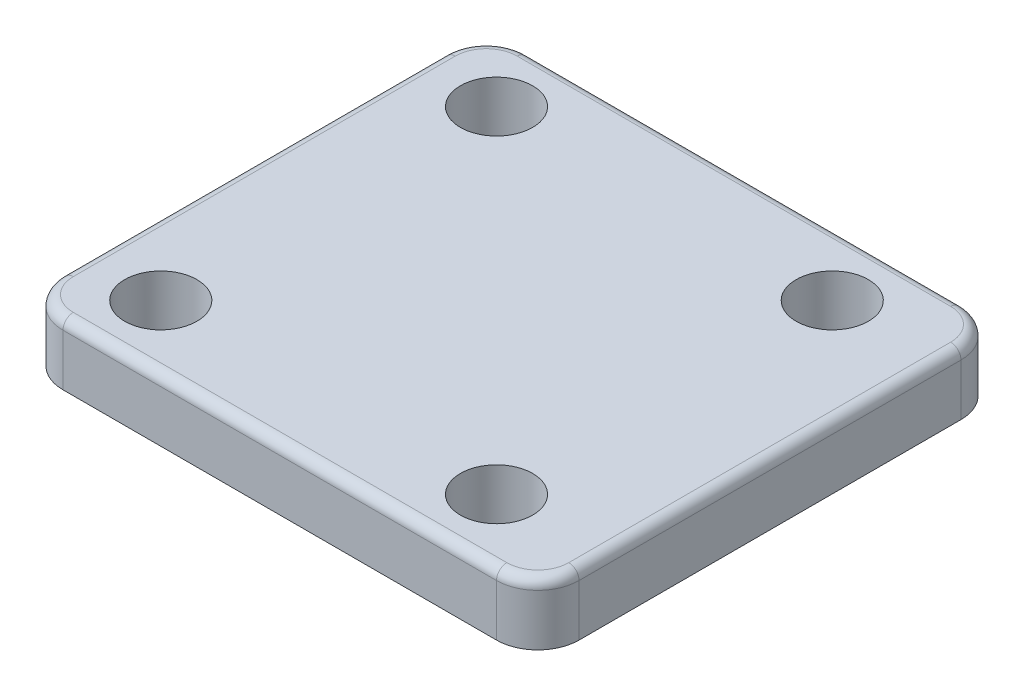
ISO-10303-21;
HEADER;
FILE_DESCRIPTION(('STEP AP214'),'2;1');
FILE_NAME('part.step','',(''),(''),'','','');
FILE_SCHEMA(('AUTOMOTIVE_DESIGN { 1 0 10303 214 1 1 1 1 }'));
ENDSEC;
DATA;
#1=APPLICATION_CONTEXT('core data for automotive mechanical design processes');
#2=APPLICATION_PROTOCOL_DEFINITION('international standard','automotive_design',2000,#1);
#3=PRODUCT_CONTEXT('',#1,'mechanical');
#4=PRODUCT('Part','Part','',(#3));
#5=PRODUCT_RELATED_PRODUCT_CATEGORY('part','',(#4));
#6=PRODUCT_DEFINITION_FORMATION('','',#4);
#7=PRODUCT_DEFINITION_CONTEXT('part definition',#1,'design');
#8=PRODUCT_DEFINITION('design','',#6,#7);
#9=PRODUCT_DEFINITION_SHAPE('','',#8);
#10=(LENGTH_UNIT() NAMED_UNIT(*) SI_UNIT(.MILLI.,.METRE.));
#11=(NAMED_UNIT(*) PLANE_ANGLE_UNIT() SI_UNIT($,.RADIAN.));
#12=(NAMED_UNIT(*) SI_UNIT($,.STERADIAN.) SOLID_ANGLE_UNIT());
#13=UNCERTAINTY_MEASURE_WITH_UNIT(LENGTH_MEASURE(1.E-05),#10,'distance_accuracy_value','');
#14=(GEOMETRIC_REPRESENTATION_CONTEXT(3) GLOBAL_UNCERTAINTY_ASSIGNED_CONTEXT((#13)) GLOBAL_UNIT_ASSIGNED_CONTEXT((#10,
#11,#12)) REPRESENTATION_CONTEXT('',''));
#15=CARTESIAN_POINT('',(0.,0.,0.));
#16=DIRECTION('',(0.,0.,1.));
#17=DIRECTION('',(1.,0.,0.));
#18=AXIS2_PLACEMENT_3D('',#15,#16,#17);
#19=CARTESIAN_POINT('',(21.,6.,18.5));
#20=DIRECTION('',(0.,-1.,0.));
#21=DIRECTION('',(0.,0.,-1.));
#22=AXIS2_PLACEMENT_3D('',#19,#20,#21);
#23=CYLINDRICAL_SURFACE('',#22,4.);
#24=DIRECTION('',(0.,-1.,0.));
#25=VECTOR('',#24,1.);
#26=CARTESIAN_POINT('',(25.,6.,18.5));
#27=LINE('',#26,#25);
#28=CARTESIAN_POINT('',(25.,5.,18.5));
#29=VERTEX_POINT('',#28);
#30=CARTESIAN_POINT('',(25.,0.,18.5));
#31=VERTEX_POINT('',#30);
#32=EDGE_CURVE('E137',#29,#31,#27,.T.);
#33=ORIENTED_EDGE('',*,*,#32,.F.);
#34=CARTESIAN_POINT('',(21.,5.,18.5));
#35=DIRECTION('',(0.,-1.,0.));
#36=DIRECTION('',(0.,0.,-1.));
#37=AXIS2_PLACEMENT_3D('',#34,#35,#36);
#38=CIRCLE('',#37,4.);
#39=CARTESIAN_POINT('',(21.,5.,22.5));
#40=VERTEX_POINT('',#39);
#41=EDGE_CURVE('E255',#29,#40,#38,.T.);
#42=ORIENTED_EDGE('',*,*,#41,.T.);
#43=DIRECTION('',(0.,-1.,0.));
#44=VECTOR('',#43,1.);
#45=CARTESIAN_POINT('',(21.,6.,22.5));
#46=LINE('',#45,#44);
#47=CARTESIAN_POINT('',(21.,0.,22.5));
#48=VERTEX_POINT('',#47);
#49=EDGE_CURVE('E160',#40,#48,#46,.T.);
#50=ORIENTED_EDGE('',*,*,#49,.T.);
#51=CARTESIAN_POINT('',(21.,0.,18.5));
#52=DIRECTION('',(0.,1.,0.));
#53=DIRECTION('',(0.,0.,-1.));
#54=AXIS2_PLACEMENT_3D('',#51,#52,#53);
#55=CIRCLE('',#54,4.);
#56=EDGE_CURVE('E153',#48,#31,#55,.T.);
#57=ORIENTED_EDGE('',*,*,#56,.T.);
#58=EDGE_LOOP('',(#33,#42,#50,#57));
#59=FACE_BOUND('',#58,.T.);
#60=ADVANCED_FACE('F47',(#59),#23,.T.);
#61=CARTESIAN_POINT('',(25.,6.,18.5));
#62=DIRECTION('',(-1.,0.,0.));
#63=DIRECTION('',(0.,0.,1.));
#64=AXIS2_PLACEMENT_3D('',#61,#62,#63);
#65=PLANE('',#64);
#66=DIRECTION('',(0.,-1.,0.));
#67=VECTOR('',#66,1.);
#68=CARTESIAN_POINT('',(25.,6.,-18.5));
#69=LINE('',#68,#67);
#70=CARTESIAN_POINT('',(25.,5.,-18.5));
#71=VERTEX_POINT('',#70);
#72=CARTESIAN_POINT('',(25.,0.,-18.5));
#73=VERTEX_POINT('',#72);
#74=EDGE_CURVE('E147',#71,#73,#69,.T.);
#75=ORIENTED_EDGE('',*,*,#74,.F.);
#76=DIRECTION('',(0.,0.,-1.));
#77=VECTOR('',#76,1.);
#78=CARTESIAN_POINT('',(25.,5.,18.5));
#79=LINE('',#78,#77);
#80=EDGE_CURVE('E64',#71,#29,#79,.F.);
#81=ORIENTED_EDGE('',*,*,#80,.T.);
#82=ORIENTED_EDGE('',*,*,#32,.T.);
#83=DIRECTION('',(0.,0.,-1.));
#84=VECTOR('',#83,1.);
#85=CARTESIAN_POINT('',(25.,0.,18.5));
#86=LINE('',#85,#84);
#87=EDGE_CURVE('E140',#31,#73,#86,.T.);
#88=ORIENTED_EDGE('',*,*,#87,.T.);
#89=EDGE_LOOP('',(#75,#81,#82,#88));
#90=FACE_BOUND('',#89,.T.);
#91=ADVANCED_FACE('F139',(#90),#65,.F.);
#92=CARTESIAN_POINT('',(21.,6.,-18.5));
#93=DIRECTION('',(0.,-1.,0.));
#94=DIRECTION('',(0.,0.,-1.));
#95=AXIS2_PLACEMENT_3D('',#92,#93,#94);
#96=CYLINDRICAL_SURFACE('',#95,4.);
#97=DIRECTION('',(0.,-1.,0.));
#98=VECTOR('',#97,1.);
#99=CARTESIAN_POINT('',(21.,6.,-22.5));
#100=LINE('',#99,#98);
#101=CARTESIAN_POINT('',(21.,5.,-22.5));
#102=VERTEX_POINT('',#101);
#103=CARTESIAN_POINT('',(21.,0.,-22.5));
#104=VERTEX_POINT('',#103);
#105=EDGE_CURVE('E206',#102,#104,#100,.T.);
#106=ORIENTED_EDGE('',*,*,#105,.F.);
#107=CARTESIAN_POINT('',(21.,5.,-18.5));
#108=DIRECTION('',(0.,-1.,0.));
#109=DIRECTION('',(0.,0.,-1.));
#110=AXIS2_PLACEMENT_3D('',#107,#108,#109);
#111=CIRCLE('',#110,4.);
#112=EDGE_CURVE('E72',#102,#71,#111,.T.);
#113=ORIENTED_EDGE('',*,*,#112,.T.);
#114=ORIENTED_EDGE('',*,*,#74,.T.);
#115=CARTESIAN_POINT('',(21.,0.,-18.5));
#116=DIRECTION('',(0.,1.,0.));
#117=DIRECTION('',(0.,0.,1.));
#118=AXIS2_PLACEMENT_3D('',#115,#116,#117);
#119=CIRCLE('',#118,4.);
#120=EDGE_CURVE('E156',#73,#104,#119,.T.);
#121=ORIENTED_EDGE('',*,*,#120,.T.);
#122=EDGE_LOOP('',(#106,#113,#114,#121));
#123=FACE_BOUND('',#122,.T.);
#124=ADVANCED_FACE('F339',(#123),#96,.T.);
#125=CARTESIAN_POINT('',(-21.,6.,-22.5));
#126=DIRECTION('',(0.,0.,1.));
#127=DIRECTION('',(1.,0.,0.));
#128=AXIS2_PLACEMENT_3D('',#125,#126,#127);
#129=PLANE('',#128);
#130=DIRECTION('',(0.,-1.,0.));
#131=VECTOR('',#130,1.);
#132=CARTESIAN_POINT('',(-21.,6.,-22.5));
#133=LINE('',#132,#131);
#134=CARTESIAN_POINT('',(-21.,5.,-22.5));
#135=VERTEX_POINT('',#134);
#136=CARTESIAN_POINT('',(-21.,0.,-22.5));
#137=VERTEX_POINT('',#136);
#138=EDGE_CURVE('E203',#135,#137,#133,.T.);
#139=ORIENTED_EDGE('',*,*,#138,.F.);
#140=DIRECTION('',(-1.,0.,0.));
#141=VECTOR('',#140,1.);
#142=CARTESIAN_POINT('',(-21.,5.,-22.5));
#143=LINE('',#142,#141);
#144=EDGE_CURVE('E248',#135,#102,#143,.F.);
#145=ORIENTED_EDGE('',*,*,#144,.T.);
#146=ORIENTED_EDGE('',*,*,#105,.T.);
#147=DIRECTION('',(-1.,0.,0.));
#148=VECTOR('',#147,1.);
#149=CARTESIAN_POINT('',(-21.,0.,-22.5));
#150=LINE('',#149,#148);
#151=EDGE_CURVE('E173',#104,#137,#150,.T.);
#152=ORIENTED_EDGE('',*,*,#151,.T.);
#153=EDGE_LOOP('',(#139,#145,#146,#152));
#154=FACE_BOUND('',#153,.T.);
#155=ADVANCED_FACE('F337',(#154),#129,.F.);
#156=CARTESIAN_POINT('',(-21.,6.,-18.5));
#157=DIRECTION('',(0.,-1.,0.));
#158=DIRECTION('',(0.,0.,-1.));
#159=AXIS2_PLACEMENT_3D('',#156,#157,#158);
#160=CYLINDRICAL_SURFACE('',#159,4.);
#161=DIRECTION('',(0.,-1.,0.));
#162=VECTOR('',#161,1.);
#163=CARTESIAN_POINT('',(-25.,6.,-18.5));
#164=LINE('',#163,#162);
#165=CARTESIAN_POINT('',(-25.,5.,-18.5));
#166=VERTEX_POINT('',#165);
#167=CARTESIAN_POINT('',(-25.,0.,-18.5));
#168=VERTEX_POINT('',#167);
#169=EDGE_CURVE('E200',#166,#168,#164,.T.);
#170=ORIENTED_EDGE('',*,*,#169,.F.);
#171=CARTESIAN_POINT('',(-21.,5.,-18.5));
#172=DIRECTION('',(0.,-1.,0.));
#173=DIRECTION('',(0.,0.,-1.));
#174=AXIS2_PLACEMENT_3D('',#171,#172,#173);
#175=CIRCLE('',#174,4.);
#176=EDGE_CURVE('E245',#166,#135,#175,.T.);
#177=ORIENTED_EDGE('',*,*,#176,.T.);
#178=ORIENTED_EDGE('',*,*,#138,.T.);
#179=CARTESIAN_POINT('',(-21.,0.,-18.5));
#180=DIRECTION('',(0.,1.,0.));
#181=DIRECTION('',(0.,0.,-1.));
#182=AXIS2_PLACEMENT_3D('',#179,#180,#181);
#183=CIRCLE('',#182,4.);
#184=EDGE_CURVE('E177',#137,#168,#183,.T.);
#185=ORIENTED_EDGE('',*,*,#184,.T.);
#186=EDGE_LOOP('',(#170,#177,#178,#185));
#187=FACE_BOUND('',#186,.T.);
#188=ADVANCED_FACE('F335',(#187),#160,.T.);
#189=CARTESIAN_POINT('',(-25.,6.,18.5));
#190=DIRECTION('',(1.,0.,0.));
#191=DIRECTION('',(0.,0.,-1.));
#192=AXIS2_PLACEMENT_3D('',#189,#190,#191);
#193=PLANE('',#192);
#194=DIRECTION('',(0.,-1.,0.));
#195=VECTOR('',#194,1.);
#196=CARTESIAN_POINT('',(-25.,6.,18.5));
#197=LINE('',#196,#195);
#198=CARTESIAN_POINT('',(-25.,5.,18.5));
#199=VERTEX_POINT('',#198);
#200=CARTESIAN_POINT('',(-25.,0.,18.5));
#201=VERTEX_POINT('',#200);
#202=EDGE_CURVE('E197',#199,#201,#197,.T.);
#203=ORIENTED_EDGE('',*,*,#202,.F.);
#204=DIRECTION('',(0.,0.,1.));
#205=VECTOR('',#204,1.);
#206=CARTESIAN_POINT('',(-25.,5.,18.5));
#207=LINE('',#206,#205);
#208=EDGE_CURVE('E242',#199,#166,#207,.F.);
#209=ORIENTED_EDGE('',*,*,#208,.T.);
#210=ORIENTED_EDGE('',*,*,#169,.T.);
#211=DIRECTION('',(0.,0.,1.));
#212=VECTOR('',#211,1.);
#213=CARTESIAN_POINT('',(-25.,0.,18.5));
#214=LINE('',#213,#212);
#215=EDGE_CURVE('E181',#168,#201,#214,.T.);
#216=ORIENTED_EDGE('',*,*,#215,.T.);
#217=EDGE_LOOP('',(#203,#209,#210,#216));
#218=FACE_BOUND('',#217,.T.);
#219=ADVANCED_FACE('F323',(#218),#193,.F.);
#220=CARTESIAN_POINT('',(-21.,6.,18.5));
#221=DIRECTION('',(0.,-1.,0.));
#222=DIRECTION('',(0.,0.,-1.));
#223=AXIS2_PLACEMENT_3D('',#220,#221,#222);
#224=CYLINDRICAL_SURFACE('',#223,4.);
#225=DIRECTION('',(0.,-1.,0.));
#226=VECTOR('',#225,1.);
#227=CARTESIAN_POINT('',(-21.,6.,22.5));
#228=LINE('',#227,#226);
#229=CARTESIAN_POINT('',(-21.,5.,22.5));
#230=VERTEX_POINT('',#229);
#231=CARTESIAN_POINT('',(-21.,0.,22.5));
#232=VERTEX_POINT('',#231);
#233=EDGE_CURVE('E194',#230,#232,#228,.T.);
#234=ORIENTED_EDGE('',*,*,#233,.F.);
#235=CARTESIAN_POINT('',(-21.,5.,18.5));
#236=DIRECTION('',(0.,-1.,0.));
#237=DIRECTION('',(0.,0.,-1.));
#238=AXIS2_PLACEMENT_3D('',#235,#236,#237);
#239=CIRCLE('',#238,4.);
#240=EDGE_CURVE('E239',#230,#199,#239,.T.);
#241=ORIENTED_EDGE('',*,*,#240,.T.);
#242=ORIENTED_EDGE('',*,*,#202,.T.);
#243=CARTESIAN_POINT('',(-21.,0.,18.5));
#244=DIRECTION('',(0.,1.,0.));
#245=DIRECTION('',(0.,0.,-1.));
#246=AXIS2_PLACEMENT_3D('',#243,#244,#245);
#247=CIRCLE('',#246,4.);
#248=EDGE_CURVE('E185',#201,#232,#247,.T.);
#249=ORIENTED_EDGE('',*,*,#248,.T.);
#250=EDGE_LOOP('',(#234,#241,#242,#249));
#251=FACE_BOUND('',#250,.T.);
#252=ADVANCED_FACE('F320',(#251),#224,.T.);
#253=CARTESIAN_POINT('',(-21.,6.,22.5));
#254=DIRECTION('',(0.,0.,-1.));
#255=DIRECTION('',(-1.,0.,0.));
#256=AXIS2_PLACEMENT_3D('',#253,#254,#255);
#257=PLANE('',#256);
#258=ORIENTED_EDGE('',*,*,#49,.F.);
#259=DIRECTION('',(1.,0.,0.));
#260=VECTOR('',#259,1.);
#261=CARTESIAN_POINT('',(-21.,5.,22.5));
#262=LINE('',#261,#260);
#263=EDGE_CURVE('E235',#40,#230,#262,.F.);
#264=ORIENTED_EDGE('',*,*,#263,.T.);
#265=ORIENTED_EDGE('',*,*,#233,.T.);
#266=DIRECTION('',(1.,0.,0.));
#267=VECTOR('',#266,1.);
#268=CARTESIAN_POINT('',(-21.,0.,22.5));
#269=LINE('',#268,#267);
#270=EDGE_CURVE('E189',#232,#48,#269,.T.);
#271=ORIENTED_EDGE('',*,*,#270,.T.);
#272=EDGE_LOOP('',(#258,#264,#265,#271));
#273=FACE_BOUND('',#272,.T.);
#274=ADVANCED_FACE('F307',(#273),#257,.F.);
#275=CARTESIAN_POINT('',(21.,6.,18.5));
#276=DIRECTION('',(0.,-1.,0.));
#277=DIRECTION('',(0.,0.,-1.));
#278=AXIS2_PLACEMENT_3D('',#275,#276,#277);
#279=PLANE('',#278);
#280=CARTESIAN_POINT('',(14.7634559672906,6.,-16.2634559672906));
#281=DIRECTION('',(0.,-1.,0.));
#282=DIRECTION('',(0.,0.,-1.));
#283=AXIS2_PLACEMENT_3D('',#280,#281,#282);
#284=CIRCLE('',#283,3.50000000000001);
#285=CARTESIAN_POINT('',(14.7634559672906,6.,-19.7634559672906));
#286=VERTEX_POINT('',#285);
#287=EDGE_CURVE('E554',#286,#286,#284,.T.);
#288=ORIENTED_EDGE('',*,*,#287,.T.);
#289=EDGE_LOOP('',(#288));
#290=FACE_BOUND('',#289,.T.);
#291=CARTESIAN_POINT('',(14.7634559672907,6.,16.2634559672905));
#292=DIRECTION('',(0.,-1.,0.));
#293=DIRECTION('',(0.,0.,-1.));
#294=AXIS2_PLACEMENT_3D('',#291,#292,#293);
#295=CIRCLE('',#294,3.50000000000001);
#296=CARTESIAN_POINT('',(14.7634559672907,6.,12.7634559672905));
#297=VERTEX_POINT('',#296);
#298=EDGE_CURVE('E558',#297,#297,#295,.T.);
#299=ORIENTED_EDGE('',*,*,#298,.T.);
#300=EDGE_LOOP('',(#299));
#301=FACE_BOUND('',#300,.T.);
#302=CARTESIAN_POINT('',(-17.7634559672907,6.,16.2634559672905));
#303=DIRECTION('',(0.,-1.,0.));
#304=DIRECTION('',(0.,0.,-1.));
#305=AXIS2_PLACEMENT_3D('',#302,#303,#304);
#306=CIRCLE('',#305,3.50000000000001);
#307=CARTESIAN_POINT('',(-17.7634559672907,6.,12.7634559672905));
#308=VERTEX_POINT('',#307);
#309=EDGE_CURVE('E562',#308,#308,#306,.T.);
#310=ORIENTED_EDGE('',*,*,#309,.T.);
#311=EDGE_LOOP('',(#310));
#312=FACE_BOUND('',#311,.T.);
#313=CARTESIAN_POINT('',(-17.7634559672907,6.,-16.2634559672905));
#314=DIRECTION('',(0.,-1.,0.));
#315=DIRECTION('',(0.,0.,-1.));
#316=AXIS2_PLACEMENT_3D('',#313,#314,#315);
#317=CIRCLE('',#316,3.50000000000001);
#318=CARTESIAN_POINT('',(-17.7634559672907,6.,-19.7634559672905));
#319=VERTEX_POINT('',#318);
#320=EDGE_CURVE('E545',#319,#319,#317,.T.);
#321=ORIENTED_EDGE('',*,*,#320,.T.);
#322=EDGE_LOOP('',(#321));
#323=FACE_BOUND('',#322,.T.);
#324=CARTESIAN_POINT('',(-21.,6.,18.5));
#325=DIRECTION('',(0.,-1.,0.));
#326=DIRECTION('',(0.,0.,-1.));
#327=AXIS2_PLACEMENT_3D('',#324,#325,#326);
#328=CIRCLE('',#327,3.);
#329=CARTESIAN_POINT('',(-24.,6.,18.5));
#330=VERTEX_POINT('',#329);
#331=CARTESIAN_POINT('',(-21.,6.,21.5));
#332=VERTEX_POINT('',#331);
#333=EDGE_CURVE('E228',#330,#332,#328,.F.);
#334=ORIENTED_EDGE('',*,*,#333,.T.);
#335=DIRECTION('',(1.,0.,0.));
#336=VECTOR('',#335,1.);
#337=CARTESIAN_POINT('',(21.,6.,21.5));
#338=LINE('',#337,#336);
#339=CARTESIAN_POINT('',(21.,6.,21.5));
#340=VERTEX_POINT('',#339);
#341=EDGE_CURVE('E231',#332,#340,#338,.T.);
#342=ORIENTED_EDGE('',*,*,#341,.T.);
#343=CARTESIAN_POINT('',(21.,6.,18.5));
#344=DIRECTION('',(0.,-1.,0.));
#345=DIRECTION('',(0.,0.,-1.));
#346=AXIS2_PLACEMENT_3D('',#343,#344,#345);
#347=CIRCLE('',#346,3.);
#348=CARTESIAN_POINT('',(24.,6.,18.5));
#349=VERTEX_POINT('',#348);
#350=EDGE_CURVE('E146',#340,#349,#347,.F.);
#351=ORIENTED_EDGE('',*,*,#350,.T.);
#352=DIRECTION('',(0.,0.,-1.));
#353=VECTOR('',#352,1.);
#354=CARTESIAN_POINT('',(24.,6.,18.5));
#355=LINE('',#354,#353);
#356=CARTESIAN_POINT('',(24.,6.,-18.5));
#357=VERTEX_POINT('',#356);
#358=EDGE_CURVE('E213',#349,#357,#355,.T.);
#359=ORIENTED_EDGE('',*,*,#358,.T.);
#360=CARTESIAN_POINT('',(21.,6.,-18.5));
#361=DIRECTION('',(0.,-1.,0.));
#362=DIRECTION('',(0.,0.,-1.));
#363=AXIS2_PLACEMENT_3D('',#360,#361,#362);
#364=CIRCLE('',#363,3.);
#365=CARTESIAN_POINT('',(21.,6.,-21.5));
#366=VERTEX_POINT('',#365);
#367=EDGE_CURVE('E216',#357,#366,#364,.F.);
#368=ORIENTED_EDGE('',*,*,#367,.T.);
#369=DIRECTION('',(-1.,0.,0.));
#370=VECTOR('',#369,1.);
#371=CARTESIAN_POINT('',(21.,6.,-21.5));
#372=LINE('',#371,#370);
#373=CARTESIAN_POINT('',(-21.,6.,-21.5));
#374=VERTEX_POINT('',#373);
#375=EDGE_CURVE('E219',#366,#374,#372,.T.);
#376=ORIENTED_EDGE('',*,*,#375,.T.);
#377=CARTESIAN_POINT('',(-21.,6.,-18.5));
#378=DIRECTION('',(0.,-1.,0.));
#379=DIRECTION('',(0.,0.,-1.));
#380=AXIS2_PLACEMENT_3D('',#377,#378,#379);
#381=CIRCLE('',#380,3.);
#382=CARTESIAN_POINT('',(-24.,6.,-18.5));
#383=VERTEX_POINT('',#382);
#384=EDGE_CURVE('E222',#374,#383,#381,.F.);
#385=ORIENTED_EDGE('',*,*,#384,.T.);
#386=DIRECTION('',(0.,0.,1.));
#387=VECTOR('',#386,1.);
#388=CARTESIAN_POINT('',(-24.,6.,18.5));
#389=LINE('',#388,#387);
#390=EDGE_CURVE('E225',#383,#330,#389,.T.);
#391=ORIENTED_EDGE('',*,*,#390,.T.);
#392=EDGE_LOOP('',(#334,#342,#351,#359,#368,#376,#385,#391));
#393=FACE_BOUND('',#392,.T.);
#394=ADVANCED_FACE('F295',(#290,#301,#312,#323,#393),#279,.F.);
#395=CARTESIAN_POINT('',(21.,0.,18.5));
#396=DIRECTION('',(0.,-1.,0.));
#397=DIRECTION('',(0.,0.,-1.));
#398=AXIS2_PLACEMENT_3D('',#395,#396,#397);
#399=PLANE('',#398);
#400=CARTESIAN_POINT('',(14.7634559672906,0.,-16.2634559672906));
#401=DIRECTION('',(0.,-1.,0.));
#402=DIRECTION('',(1.,0.,0.));
#403=AXIS2_PLACEMENT_3D('',#400,#401,#402);
#404=CIRCLE('',#403,3.50000000000001);
#405=CARTESIAN_POINT('',(18.2634559672906,0.,-16.2634559672906));
#406=VERTEX_POINT('',#405);
#407=EDGE_CURVE('E566',#406,#406,#404,.T.);
#408=ORIENTED_EDGE('',*,*,#407,.F.);
#409=EDGE_LOOP('',(#408));
#410=FACE_BOUND('',#409,.T.);
#411=CARTESIAN_POINT('',(14.7634559672907,0.,16.2634559672905));
#412=DIRECTION('',(0.,-1.,0.));
#413=DIRECTION('',(0.,0.,1.));
#414=AXIS2_PLACEMENT_3D('',#411,#412,#413);
#415=CIRCLE('',#414,3.50000000000001);
#416=CARTESIAN_POINT('',(14.7634559672907,0.,19.7634559672905));
#417=VERTEX_POINT('',#416);
#418=EDGE_CURVE('E571',#417,#417,#415,.T.);
#419=ORIENTED_EDGE('',*,*,#418,.F.);
#420=EDGE_LOOP('',(#419));
#421=FACE_BOUND('',#420,.T.);
#422=CARTESIAN_POINT('',(-17.7634559672907,0.,16.2634559672905));
#423=DIRECTION('',(0.,-1.,0.));
#424=DIRECTION('',(-1.,0.,0.));
#425=AXIS2_PLACEMENT_3D('',#422,#423,#424);
#426=CIRCLE('',#425,3.50000000000001);
#427=CARTESIAN_POINT('',(-21.2634559672907,0.,16.2634559672905));
#428=VERTEX_POINT('',#427);
#429=EDGE_CURVE('E567',#428,#428,#426,.T.);
#430=ORIENTED_EDGE('',*,*,#429,.F.);
#431=EDGE_LOOP('',(#430));
#432=FACE_BOUND('',#431,.T.);
#433=CARTESIAN_POINT('',(-17.7634559672907,0.,-16.2634559672905));
#434=DIRECTION('',(0.,-1.,0.));
#435=DIRECTION('',(0.,0.,-1.));
#436=AXIS2_PLACEMENT_3D('',#433,#434,#435);
#437=CIRCLE('',#436,3.50000000000001);
#438=CARTESIAN_POINT('',(-17.7634559672907,0.,-19.7634559672905));
#439=VERTEX_POINT('',#438);
#440=EDGE_CURVE('E548',#439,#439,#437,.T.);
#441=ORIENTED_EDGE('',*,*,#440,.F.);
#442=EDGE_LOOP('',(#441));
#443=FACE_BOUND('',#442,.T.);
#444=CARTESIAN_POINT('',(-1.5,0.,0.));
#445=DIRECTION('',(0.,-1.,0.));
#446=DIRECTION('',(0.,0.,-1.));
#447=AXIS2_PLACEMENT_3D('',#444,#445,#446);
#448=CIRCLE('',#447,16.);
#449=CARTESIAN_POINT('',(-1.5,0.,-16.));
#450=VERTEX_POINT('',#449);
#451=EDGE_CURVE('E57',#450,#450,#448,.T.);
#452=ORIENTED_EDGE('',*,*,#451,.F.);
#453=EDGE_LOOP('',(#452));
#454=FACE_BOUND('',#453,.T.);
#455=ORIENTED_EDGE('',*,*,#56,.F.);
#456=ORIENTED_EDGE('',*,*,#270,.F.);
#457=ORIENTED_EDGE('',*,*,#248,.F.);
#458=ORIENTED_EDGE('',*,*,#215,.F.);
#459=ORIENTED_EDGE('',*,*,#184,.F.);
#460=ORIENTED_EDGE('',*,*,#151,.F.);
#461=ORIENTED_EDGE('',*,*,#120,.F.);
#462=ORIENTED_EDGE('',*,*,#87,.F.);
#463=EDGE_LOOP('',(#455,#456,#457,#458,#459,#460,#461,#462));
#464=FACE_BOUND('',#463,.T.);
#465=ADVANCED_FACE('F151',(#410,#421,#432,#443,#454,#464),#399,.T.);
#466=CARTESIAN_POINT('',(21.,5.,-21.5));
#467=DIRECTION('',(-1.,0.,0.));
#468=DIRECTION('',(0.,0.,1.));
#469=AXIS2_PLACEMENT_3D('',#466,#467,#468);
#470=CYLINDRICAL_SURFACE('',#469,1.);
#471=CARTESIAN_POINT('',(21.,5.,-21.5));
#472=DIRECTION('',(1.,0.,0.));
#473=DIRECTION('',(0.,0.,-1.));
#474=AXIS2_PLACEMENT_3D('',#471,#472,#473);
#475=CIRCLE('',#474,1.);
#476=EDGE_CURVE('E167',#102,#366,#475,.T.);
#477=ORIENTED_EDGE('',*,*,#476,.F.);
#478=ORIENTED_EDGE('',*,*,#144,.F.);
#479=CARTESIAN_POINT('',(-21.,5.,-21.5));
#480=DIRECTION('',(-1.,0.,0.));
#481=DIRECTION('',(0.,0.,1.));
#482=AXIS2_PLACEMENT_3D('',#479,#480,#481);
#483=CIRCLE('',#482,1.);
#484=EDGE_CURVE('E163',#374,#135,#483,.T.);
#485=ORIENTED_EDGE('',*,*,#484,.F.);
#486=ORIENTED_EDGE('',*,*,#375,.F.);
#487=EDGE_LOOP('',(#477,#478,#485,#486));
#488=FACE_BOUND('',#487,.T.);
#489=ADVANCED_FACE('F291',(#488),#470,.T.);
#490=CARTESIAN_POINT('',(-21.,5.,-18.5));
#491=DIRECTION('',(0.,-1.,0.));
#492=DIRECTION('',(0.,0.,-1.));
#493=AXIS2_PLACEMENT_3D('',#490,#491,#492);
#494=TOROIDAL_SURFACE('',#493,3.,1.);
#495=ORIENTED_EDGE('',*,*,#484,.T.);
#496=ORIENTED_EDGE('',*,*,#176,.F.);
#497=CARTESIAN_POINT('',(-24.,5.,-18.5));
#498=DIRECTION('',(0.,0.,1.));
#499=DIRECTION('',(1.,0.,0.));
#500=AXIS2_PLACEMENT_3D('',#497,#498,#499);
#501=CIRCLE('',#500,1.);
#502=EDGE_CURVE('E277',#383,#166,#501,.T.);
#503=ORIENTED_EDGE('',*,*,#502,.F.);
#504=ORIENTED_EDGE('',*,*,#384,.F.);
#505=EDGE_LOOP('',(#495,#496,#503,#504));
#506=FACE_BOUND('',#505,.T.);
#507=ADVANCED_FACE('F332',(#506),#494,.T.);
#508=CARTESIAN_POINT('',(21.,5.,-18.5));
#509=DIRECTION('',(0.,-1.,0.));
#510=DIRECTION('',(0.,0.,-1.));
#511=AXIS2_PLACEMENT_3D('',#508,#509,#510);
#512=TOROIDAL_SURFACE('',#511,3.,1.);
#513=ORIENTED_EDGE('',*,*,#476,.T.);
#514=ORIENTED_EDGE('',*,*,#367,.F.);
#515=CARTESIAN_POINT('',(24.,5.,-18.5));
#516=DIRECTION('',(0.,0.,1.));
#517=DIRECTION('',(1.,0.,0.));
#518=AXIS2_PLACEMENT_3D('',#515,#516,#517);
#519=CIRCLE('',#518,1.);
#520=EDGE_CURVE('E273',#71,#357,#519,.T.);
#521=ORIENTED_EDGE('',*,*,#520,.F.);
#522=ORIENTED_EDGE('',*,*,#112,.F.);
#523=EDGE_LOOP('',(#513,#514,#521,#522));
#524=FACE_BOUND('',#523,.T.);
#525=ADVANCED_FACE('F286',(#524),#512,.T.);
#526=CARTESIAN_POINT('',(-24.,5.,18.5));
#527=DIRECTION('',(0.,0.,1.));
#528=DIRECTION('',(1.,0.,0.));
#529=AXIS2_PLACEMENT_3D('',#526,#527,#528);
#530=CYLINDRICAL_SURFACE('',#529,1.);
#531=ORIENTED_EDGE('',*,*,#502,.T.);
#532=ORIENTED_EDGE('',*,*,#208,.F.);
#533=CARTESIAN_POINT('',(-24.,5.,18.5));
#534=DIRECTION('',(0.,0.,1.));
#535=DIRECTION('',(1.,0.,0.));
#536=AXIS2_PLACEMENT_3D('',#533,#534,#535);
#537=CIRCLE('',#536,1.);
#538=EDGE_CURVE('E269',#330,#199,#537,.T.);
#539=ORIENTED_EDGE('',*,*,#538,.F.);
#540=ORIENTED_EDGE('',*,*,#390,.F.);
#541=EDGE_LOOP('',(#531,#532,#539,#540));
#542=FACE_BOUND('',#541,.T.);
#543=ADVANCED_FACE('F328',(#542),#530,.T.);
#544=CARTESIAN_POINT('',(24.,5.,18.5));
#545=DIRECTION('',(0.,0.,-1.));
#546=DIRECTION('',(-1.,0.,0.));
#547=AXIS2_PLACEMENT_3D('',#544,#545,#546);
#548=CYLINDRICAL_SURFACE('',#547,1.);
#549=ORIENTED_EDGE('',*,*,#520,.T.);
#550=ORIENTED_EDGE('',*,*,#358,.F.);
#551=CARTESIAN_POINT('',(24.,5.,18.5));
#552=DIRECTION('',(0.,0.,1.));
#553=DIRECTION('',(1.,0.,0.));
#554=AXIS2_PLACEMENT_3D('',#551,#552,#553);
#555=CIRCLE('',#554,1.);
#556=EDGE_CURVE('E265',#29,#349,#555,.T.);
#557=ORIENTED_EDGE('',*,*,#556,.F.);
#558=ORIENTED_EDGE('',*,*,#80,.F.);
#559=EDGE_LOOP('',(#549,#550,#557,#558));
#560=FACE_BOUND('',#559,.T.);
#561=ADVANCED_FACE('F300',(#560),#548,.T.);
#562=CARTESIAN_POINT('',(-21.,5.,18.5));
#563=DIRECTION('',(0.,-1.,0.));
#564=DIRECTION('',(0.,0.,-1.));
#565=AXIS2_PLACEMENT_3D('',#562,#563,#564);
#566=TOROIDAL_SURFACE('',#565,3.,1.);
#567=ORIENTED_EDGE('',*,*,#538,.T.);
#568=ORIENTED_EDGE('',*,*,#240,.F.);
#569=CARTESIAN_POINT('',(-21.,5.,21.5));
#570=DIRECTION('',(1.,0.,0.));
#571=DIRECTION('',(0.,0.,-1.));
#572=AXIS2_PLACEMENT_3D('',#569,#570,#571);
#573=CIRCLE('',#572,1.);
#574=EDGE_CURVE('E261',#332,#230,#573,.T.);
#575=ORIENTED_EDGE('',*,*,#574,.F.);
#576=ORIENTED_EDGE('',*,*,#333,.F.);
#577=EDGE_LOOP('',(#567,#568,#575,#576));
#578=FACE_BOUND('',#577,.T.);
#579=ADVANCED_FACE('F316',(#578),#566,.T.);
#580=CARTESIAN_POINT('',(21.,5.,18.5));
#581=DIRECTION('',(0.,-1.,0.));
#582=DIRECTION('',(0.,0.,-1.));
#583=AXIS2_PLACEMENT_3D('',#580,#581,#582);
#584=TOROIDAL_SURFACE('',#583,3.,1.);
#585=ORIENTED_EDGE('',*,*,#556,.T.);
#586=ORIENTED_EDGE('',*,*,#350,.F.);
#587=CARTESIAN_POINT('',(21.,5.,21.5));
#588=DIRECTION('',(-1.,0.,0.));
#589=DIRECTION('',(0.,0.,1.));
#590=AXIS2_PLACEMENT_3D('',#587,#588,#589);
#591=CIRCLE('',#590,1.);
#592=EDGE_CURVE('E258',#40,#340,#591,.T.);
#593=ORIENTED_EDGE('',*,*,#592,.F.);
#594=ORIENTED_EDGE('',*,*,#41,.F.);
#595=EDGE_LOOP('',(#585,#586,#593,#594));
#596=FACE_BOUND('',#595,.T.);
#597=ADVANCED_FACE('F303',(#596),#584,.T.);
#598=CARTESIAN_POINT('',(21.,5.,21.5));
#599=DIRECTION('',(1.,0.,0.));
#600=DIRECTION('',(0.,0.,-1.));
#601=AXIS2_PLACEMENT_3D('',#598,#599,#600);
#602=CYLINDRICAL_SURFACE('',#601,1.);
#603=ORIENTED_EDGE('',*,*,#574,.T.);
#604=ORIENTED_EDGE('',*,*,#263,.F.);
#605=ORIENTED_EDGE('',*,*,#592,.T.);
#606=ORIENTED_EDGE('',*,*,#341,.F.);
#607=EDGE_LOOP('',(#603,#604,#605,#606));
#608=FACE_BOUND('',#607,.T.);
#609=ADVANCED_FACE('F310',(#608),#602,.T.);
#610=CARTESIAN_POINT('',(-1.5,-0.5,0.));
#611=DIRECTION('',(0.,1.,0.));
#612=DIRECTION('',(0.,0.,1.));
#613=AXIS2_PLACEMENT_3D('',#610,#611,#612);
#614=CYLINDRICAL_SURFACE('',#613,16.);
#615=CARTESIAN_POINT('',(-1.5,-0.5,0.));
#616=DIRECTION('',(0.,-1.,0.));
#617=DIRECTION('',(0.,0.,-1.));
#618=AXIS2_PLACEMENT_3D('',#615,#616,#617);
#619=CIRCLE('',#618,16.);
#620=CARTESIAN_POINT('',(-1.5,-0.5,-16.));
#621=VERTEX_POINT('',#620);
#622=EDGE_CURVE('E262',#621,#621,#619,.T.);
#623=ORIENTED_EDGE('',*,*,#622,.F.);
#624=EDGE_LOOP('',(#623));
#625=FACE_BOUND('',#624,.T.);
#626=ORIENTED_EDGE('',*,*,#451,.T.);
#627=EDGE_LOOP('',(#626));
#628=FACE_BOUND('',#627,.T.);
#629=ADVANCED_FACE('F355',(#625,#628),#614,.T.);
#630=CARTESIAN_POINT('',(-1.5,-1.,0.));
#631=DIRECTION('',(0.,-1.,0.));
#632=DIRECTION('',(0.,0.,-1.));
#633=AXIS2_PLACEMENT_3D('',#630,#631,#632);
#634=PLANE('',#633);
#635=CARTESIAN_POINT('',(-1.5,-1.,0.));
#636=DIRECTION('',(0.,-1.,0.));
#637=DIRECTION('',(0.,0.,-1.));
#638=AXIS2_PLACEMENT_3D('',#635,#636,#637);
#639=CIRCLE('',#638,15.5);
#640=CARTESIAN_POINT('',(-1.5,-1.,-15.5));
#641=VERTEX_POINT('',#640);
#642=EDGE_CURVE('E13',#641,#641,#639,.T.);
#643=ORIENTED_EDGE('',*,*,#642,.T.);
#644=EDGE_LOOP('',(#643));
#645=FACE_BOUND('',#644,.T.);
#646=ADVANCED_FACE('F468',(#645),#634,.T.);
#647=CARTESIAN_POINT('',(-1.5,-1.5,0.));
#648=DIRECTION('',(0.,1.,0.));
#649=DIRECTION('',(0.,0.,1.));
#650=AXIS2_PLACEMENT_3D('',#647,#648,#649);
#651=CONICAL_SURFACE('',#650,15.,0.785398163397448);
#652=ORIENTED_EDGE('',*,*,#622,.T.);
#653=EDGE_LOOP('',(#652));
#654=FACE_BOUND('',#653,.T.);
#655=ORIENTED_EDGE('',*,*,#642,.F.);
#656=EDGE_LOOP('',(#655));
#657=FACE_BOUND('',#656,.T.);
#658=ADVANCED_FACE('F50',(#654,#657),#651,.T.);
#659=CARTESIAN_POINT('',(-17.7634559672907,10.,-16.2634559672905));
#660=DIRECTION('',(0.,-1.,0.));
#661=DIRECTION('',(0.,0.,-1.));
#662=AXIS2_PLACEMENT_3D('',#659,#660,#661);
#663=CYLINDRICAL_SURFACE('',#662,3.50000000000001);
#664=ORIENTED_EDGE('',*,*,#440,.T.);
#665=EDGE_LOOP('',(#664));
#666=FACE_BOUND('',#665,.T.);
#667=ORIENTED_EDGE('',*,*,#320,.F.);
#668=EDGE_LOOP('',(#667));
#669=FACE_BOUND('',#668,.T.);
#670=ADVANCED_FACE('F415',(#666,#669),#663,.F.);
#671=CARTESIAN_POINT('',(-17.7634559672907,10.,16.2634559672905));
#672=DIRECTION('',(0.,-1.,0.));
#673=DIRECTION('',(0.,0.,-1.));
#674=AXIS2_PLACEMENT_3D('',#671,#672,#673);
#675=CYLINDRICAL_SURFACE('',#674,3.50000000000001);
#676=ORIENTED_EDGE('',*,*,#429,.T.);
#677=EDGE_LOOP('',(#676));
#678=FACE_BOUND('',#677,.T.);
#679=ORIENTED_EDGE('',*,*,#309,.F.);
#680=EDGE_LOOP('',(#679));
#681=FACE_BOUND('',#680,.T.);
#682=ADVANCED_FACE('F425',(#678,#681),#675,.F.);
#683=CARTESIAN_POINT('',(14.7634559672907,10.,16.2634559672905));
#684=DIRECTION('',(0.,-1.,0.));
#685=DIRECTION('',(0.,0.,-1.));
#686=AXIS2_PLACEMENT_3D('',#683,#684,#685);
#687=CYLINDRICAL_SURFACE('',#686,3.50000000000001);
#688=ORIENTED_EDGE('',*,*,#418,.T.);
#689=EDGE_LOOP('',(#688));
#690=FACE_BOUND('',#689,.T.);
#691=ORIENTED_EDGE('',*,*,#298,.F.);
#692=EDGE_LOOP('',(#691));
#693=FACE_BOUND('',#692,.T.);
#694=ADVANCED_FACE('F431',(#690,#693),#687,.F.);
#695=CARTESIAN_POINT('',(14.7634559672906,10.,-16.2634559672906));
#696=DIRECTION('',(0.,-1.,0.));
#697=DIRECTION('',(0.,0.,-1.));
#698=AXIS2_PLACEMENT_3D('',#695,#696,#697);
#699=CYLINDRICAL_SURFACE('',#698,3.50000000000001);
#700=ORIENTED_EDGE('',*,*,#407,.T.);
#701=EDGE_LOOP('',(#700));
#702=FACE_BOUND('',#701,.T.);
#703=ORIENTED_EDGE('',*,*,#287,.F.);
#704=EDGE_LOOP('',(#703));
#705=FACE_BOUND('',#704,.T.);
#706=ADVANCED_FACE('F442',(#702,#705),#699,.F.);
#707=CLOSED_SHELL('',(#60,#91,#124,#155,#188,#219,#252,#274,#394,#465,#489,#507,#525,#543,#561,
#579,#597,#609,#629,#646,#658,#670,#682,#694,#706));
#708=MANIFOLD_SOLID_BREP('B2',#707);
#709=ADVANCED_BREP_SHAPE_REPRESENTATION('',(#18,#708),#14);
#710=SHAPE_DEFINITION_REPRESENTATION(#9,#709);
ENDSEC;
END-ISO-10303-21;
